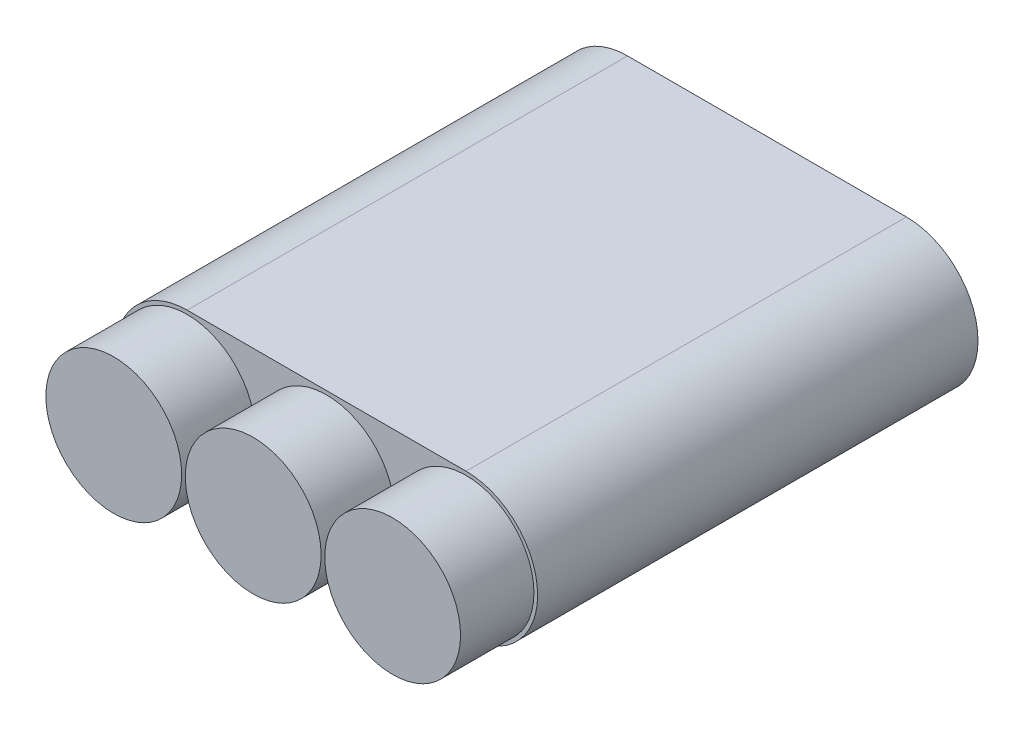
ISO-10303-21;
HEADER;
FILE_DESCRIPTION(('STEP AP214'),'2;1');
FILE_NAME('part.step','',(''),(''),'','','');
FILE_SCHEMA(('AUTOMOTIVE_DESIGN { 1 0 10303 214 1 1 1 1 }'));
ENDSEC;
DATA;
#1=APPLICATION_CONTEXT('core data for automotive mechanical design processes');
#2=APPLICATION_PROTOCOL_DEFINITION('international standard','automotive_design',2000,#1);
#3=PRODUCT_CONTEXT('',#1,'mechanical');
#4=PRODUCT('Part','Part','',(#3));
#5=PRODUCT_RELATED_PRODUCT_CATEGORY('part','',(#4));
#6=PRODUCT_DEFINITION_FORMATION('','',#4);
#7=PRODUCT_DEFINITION_CONTEXT('part definition',#1,'design');
#8=PRODUCT_DEFINITION('design','',#6,#7);
#9=PRODUCT_DEFINITION_SHAPE('','',#8);
#10=(LENGTH_UNIT() NAMED_UNIT(*) SI_UNIT(.MILLI.,.METRE.));
#11=(NAMED_UNIT(*) PLANE_ANGLE_UNIT() SI_UNIT($,.RADIAN.));
#12=(NAMED_UNIT(*) SI_UNIT($,.STERADIAN.) SOLID_ANGLE_UNIT());
#13=UNCERTAINTY_MEASURE_WITH_UNIT(LENGTH_MEASURE(1.E-05),#10,'distance_accuracy_value','');
#14=(GEOMETRIC_REPRESENTATION_CONTEXT(3) GLOBAL_UNCERTAINTY_ASSIGNED_CONTEXT((#13)) GLOBAL_UNIT_ASSIGNED_CONTEXT((#10,
#11,#12)) REPRESENTATION_CONTEXT('',''));
#15=CARTESIAN_POINT('',(0.,0.,0.));
#16=DIRECTION('',(0.,0.,1.));
#17=DIRECTION('',(1.,0.,0.));
#18=AXIS2_PLACEMENT_3D('',#15,#16,#17);
#19=CARTESIAN_POINT('',(-19.,0.,10.));
#20=DIRECTION('',(0.,0.,-1.));
#21=DIRECTION('',(-1.,0.,0.));
#22=AXIS2_PLACEMENT_3D('',#19,#20,#21);
#23=CYLINDRICAL_SURFACE('',#22,9.25);
#24=CARTESIAN_POINT('',(-19.,0.,10.));
#25=DIRECTION('',(0.,0.,1.));
#26=DIRECTION('',(1.,0.,0.));
#27=AXIS2_PLACEMENT_3D('',#24,#25,#26);
#28=CIRCLE('',#27,9.25);
#29=CARTESIAN_POINT('',(-9.75,0.,10.));
#30=VERTEX_POINT('',#29);
#31=EDGE_CURVE('E11',#30,#30,#28,.T.);
#32=ORIENTED_EDGE('',*,*,#31,.F.);
#33=EDGE_LOOP('',(#32));
#34=FACE_BOUND('',#33,.T.);
#35=CARTESIAN_POINT('',(-19.,0.,0.));
#36=DIRECTION('',(0.,0.,1.));
#37=DIRECTION('',(1.,0.,0.));
#38=AXIS2_PLACEMENT_3D('',#35,#36,#37);
#39=CIRCLE('',#38,9.25);
#40=CARTESIAN_POINT('',(-9.75,0.,0.));
#41=VERTEX_POINT('',#40);
#42=EDGE_CURVE('E39',#41,#41,#39,.T.);
#43=ORIENTED_EDGE('',*,*,#42,.T.);
#44=EDGE_LOOP('',(#43));
#45=FACE_BOUND('',#44,.T.);
#46=ADVANCED_FACE('F36',(#34,#45),#23,.T.);
#47=CARTESIAN_POINT('',(0.,0.,10.));
#48=DIRECTION('',(0.,0.,1.));
#49=DIRECTION('',(1.,0.,0.));
#50=AXIS2_PLACEMENT_3D('',#47,#48,#49);
#51=PLANE('',#50);
#52=ORIENTED_EDGE('',*,*,#31,.T.);
#53=EDGE_LOOP('',(#52));
#54=FACE_BOUND('',#53,.T.);
#55=ADVANCED_FACE('F126',(#54),#51,.T.);
#56=CARTESIAN_POINT('',(0.,-9.75000000000001,-60.));
#57=DIRECTION('',(0.,-1.,0.));
#58=DIRECTION('',(1.,0.,0.));
#59=AXIS2_PLACEMENT_3D('',#56,#57,#58);
#60=PLANE('',#59);
#61=DIRECTION('',(1.,0.,0.));
#62=VECTOR('',#61,1.);
#63=CARTESIAN_POINT('',(0.,-9.75000000000001,0.));
#64=LINE('',#63,#62);
#65=CARTESIAN_POINT('',(-19.,-9.75000000000001,0.));
#66=VERTEX_POINT('',#65);
#67=CARTESIAN_POINT('',(19.,-9.75,0.));
#68=VERTEX_POINT('',#67);
#69=EDGE_CURVE('E104',#66,#68,#64,.T.);
#70=ORIENTED_EDGE('',*,*,#69,.F.);
#71=DIRECTION('',(0.,0.,1.));
#72=VECTOR('',#71,1.);
#73=CARTESIAN_POINT('',(-19.,-9.75000000000001,-60.));
#74=LINE('',#73,#72);
#75=CARTESIAN_POINT('',(-19.,-9.75000000000001,-60.));
#76=VERTEX_POINT('',#75);
#77=EDGE_CURVE('E52',#76,#66,#74,.T.);
#78=ORIENTED_EDGE('',*,*,#77,.F.);
#79=DIRECTION('',(1.,0.,0.));
#80=VECTOR('',#79,1.);
#81=CARTESIAN_POINT('',(0.,-9.75000000000001,-60.));
#82=LINE('',#81,#80);
#83=CARTESIAN_POINT('',(19.,-9.75,-60.));
#84=VERTEX_POINT('',#83);
#85=EDGE_CURVE('E97',#76,#84,#82,.T.);
#86=ORIENTED_EDGE('',*,*,#85,.T.);
#87=DIRECTION('',(0.,0.,1.));
#88=VECTOR('',#87,1.);
#89=CARTESIAN_POINT('',(19.,-9.75,-60.));
#90=LINE('',#89,#88);
#91=EDGE_CURVE('E80',#84,#68,#90,.T.);
#92=ORIENTED_EDGE('',*,*,#91,.T.);
#93=EDGE_LOOP('',(#70,#78,#86,#92));
#94=FACE_BOUND('',#93,.T.);
#95=ADVANCED_FACE('F115',(#94),#60,.T.);
#96=CARTESIAN_POINT('',(-19.,0.,-60.));
#97=DIRECTION('',(0.,0.,1.));
#98=DIRECTION('',(1.,0.,0.));
#99=AXIS2_PLACEMENT_3D('',#96,#97,#98);
#100=CYLINDRICAL_SURFACE('',#99,9.75000000000001);
#101=CARTESIAN_POINT('',(-19.,0.,0.));
#102=DIRECTION('',(0.,0.,1.));
#103=DIRECTION('',(1.,0.,0.));
#104=AXIS2_PLACEMENT_3D('',#101,#102,#103);
#105=CIRCLE('',#104,9.75000000000001);
#106=CARTESIAN_POINT('',(-19.,9.75000000000001,0.));
#107=VERTEX_POINT('',#106);
#108=EDGE_CURVE('E99',#107,#66,#105,.T.);
#109=ORIENTED_EDGE('',*,*,#108,.F.);
#110=DIRECTION('',(0.,0.,1.));
#111=VECTOR('',#110,1.);
#112=CARTESIAN_POINT('',(-19.,9.75000000000001,-60.));
#113=LINE('',#112,#111);
#114=CARTESIAN_POINT('',(-19.,9.75000000000001,-60.));
#115=VERTEX_POINT('',#114);
#116=EDGE_CURVE('E69',#115,#107,#113,.T.);
#117=ORIENTED_EDGE('',*,*,#116,.F.);
#118=CARTESIAN_POINT('',(-19.,0.,-60.));
#119=DIRECTION('',(0.,0.,1.));
#120=DIRECTION('',(1.,0.,0.));
#121=AXIS2_PLACEMENT_3D('',#118,#119,#120);
#122=CIRCLE('',#121,9.75000000000001);
#123=EDGE_CURVE('E89',#115,#76,#122,.T.);
#124=ORIENTED_EDGE('',*,*,#123,.T.);
#125=ORIENTED_EDGE('',*,*,#77,.T.);
#126=EDGE_LOOP('',(#109,#117,#124,#125));
#127=FACE_BOUND('',#126,.T.);
#128=ADVANCED_FACE('F118',(#127),#100,.T.);
#129=CARTESIAN_POINT('',(0.,9.75000000000001,-60.));
#130=DIRECTION('',(0.,-1.,0.));
#131=DIRECTION('',(1.,0.,0.));
#132=AXIS2_PLACEMENT_3D('',#129,#130,#131);
#133=PLANE('',#132);
#134=DIRECTION('',(1.,0.,0.));
#135=VECTOR('',#134,1.);
#136=CARTESIAN_POINT('',(0.,9.75000000000001,0.));
#137=LINE('',#136,#135);
#138=CARTESIAN_POINT('',(19.,9.75000000000002,0.));
#139=VERTEX_POINT('',#138);
#140=EDGE_CURVE('E93',#107,#139,#137,.T.);
#141=ORIENTED_EDGE('',*,*,#140,.T.);
#142=DIRECTION('',(0.,0.,1.));
#143=VECTOR('',#142,1.);
#144=CARTESIAN_POINT('',(19.,9.75000000000002,-60.));
#145=LINE('',#144,#143);
#146=CARTESIAN_POINT('',(19.,9.75000000000002,-60.));
#147=VERTEX_POINT('',#146);
#148=EDGE_CURVE('E91',#147,#139,#145,.T.);
#149=ORIENTED_EDGE('',*,*,#148,.F.);
#150=DIRECTION('',(1.,0.,0.));
#151=VECTOR('',#150,1.);
#152=CARTESIAN_POINT('',(0.,9.75000000000001,-60.));
#153=LINE('',#152,#151);
#154=EDGE_CURVE('E85',#115,#147,#153,.T.);
#155=ORIENTED_EDGE('',*,*,#154,.F.);
#156=ORIENTED_EDGE('',*,*,#116,.T.);
#157=EDGE_LOOP('',(#141,#149,#155,#156));
#158=FACE_BOUND('',#157,.T.);
#159=ADVANCED_FACE('F92',(#158),#133,.F.);
#160=CARTESIAN_POINT('',(19.,0.,-60.));
#161=DIRECTION('',(0.,0.,1.));
#162=DIRECTION('',(1.,0.,0.));
#163=AXIS2_PLACEMENT_3D('',#160,#161,#162);
#164=CYLINDRICAL_SURFACE('',#163,9.75000000000001);
#165=CARTESIAN_POINT('',(19.,0.,0.));
#166=DIRECTION('',(0.,0.,1.));
#167=DIRECTION('',(1.,0.,0.));
#168=AXIS2_PLACEMENT_3D('',#165,#166,#167);
#169=CIRCLE('',#168,9.75000000000001);
#170=EDGE_CURVE('E107',#68,#139,#169,.T.);
#171=ORIENTED_EDGE('',*,*,#170,.F.);
#172=ORIENTED_EDGE('',*,*,#91,.F.);
#173=CARTESIAN_POINT('',(19.,0.,-60.));
#174=DIRECTION('',(0.,0.,1.));
#175=DIRECTION('',(1.,0.,0.));
#176=AXIS2_PLACEMENT_3D('',#173,#174,#175);
#177=CIRCLE('',#176,9.75000000000001);
#178=EDGE_CURVE('E88',#84,#147,#177,.T.);
#179=ORIENTED_EDGE('',*,*,#178,.T.);
#180=ORIENTED_EDGE('',*,*,#148,.T.);
#181=EDGE_LOOP('',(#171,#172,#179,#180));
#182=FACE_BOUND('',#181,.T.);
#183=ADVANCED_FACE('F96',(#182),#164,.T.);
#184=CARTESIAN_POINT('',(0.,0.,-60.));
#185=DIRECTION('',(0.,0.,1.));
#186=DIRECTION('',(1.,0.,0.));
#187=AXIS2_PLACEMENT_3D('',#184,#185,#186);
#188=PLANE('',#187);
#189=ORIENTED_EDGE('',*,*,#85,.F.);
#190=ORIENTED_EDGE('',*,*,#123,.F.);
#191=ORIENTED_EDGE('',*,*,#154,.T.);
#192=ORIENTED_EDGE('',*,*,#178,.F.);
#193=EDGE_LOOP('',(#189,#190,#191,#192));
#194=FACE_BOUND('',#193,.T.);
#195=ADVANCED_FACE('F87',(#194),#188,.F.);
#196=CARTESIAN_POINT('',(0.,0.,0.));
#197=DIRECTION('',(0.,0.,1.));
#198=DIRECTION('',(1.,0.,0.));
#199=AXIS2_PLACEMENT_3D('',#196,#197,#198);
#200=PLANE('',#199);
#201=CARTESIAN_POINT('',(19.,0.,0.));
#202=DIRECTION('',(0.,0.,1.));
#203=DIRECTION('',(1.,0.,0.));
#204=AXIS2_PLACEMENT_3D('',#201,#202,#203);
#205=CIRCLE('',#204,9.25000000000001);
#206=CARTESIAN_POINT('',(28.25,0.,0.));
#207=VERTEX_POINT('',#206);
#208=EDGE_CURVE('E170',#207,#207,#205,.T.);
#209=ORIENTED_EDGE('',*,*,#208,.F.);
#210=EDGE_LOOP('',(#209));
#211=FACE_BOUND('',#210,.T.);
#212=CARTESIAN_POINT('',(0.,0.,0.));
#213=DIRECTION('',(0.,0.,1.));
#214=DIRECTION('',(1.,0.,0.));
#215=AXIS2_PLACEMENT_3D('',#212,#213,#214);
#216=CIRCLE('',#215,9.25);
#217=CARTESIAN_POINT('',(9.25,0.,0.));
#218=VERTEX_POINT('',#217);
#219=EDGE_CURVE('E169',#218,#218,#216,.T.);
#220=ORIENTED_EDGE('',*,*,#219,.F.);
#221=EDGE_LOOP('',(#220));
#222=FACE_BOUND('',#221,.T.);
#223=ORIENTED_EDGE('',*,*,#42,.F.);
#224=EDGE_LOOP('',(#223));
#225=FACE_BOUND('',#224,.T.);
#226=ORIENTED_EDGE('',*,*,#69,.T.);
#227=ORIENTED_EDGE('',*,*,#170,.T.);
#228=ORIENTED_EDGE('',*,*,#140,.F.);
#229=ORIENTED_EDGE('',*,*,#108,.T.);
#230=EDGE_LOOP('',(#226,#227,#228,#229));
#231=FACE_BOUND('',#230,.T.);
#232=ADVANCED_FACE('F117',(#211,#222,#225,#231),#200,.T.);
#233=CARTESIAN_POINT('',(0.,0.,10.));
#234=DIRECTION('',(0.,0.,-1.));
#235=DIRECTION('',(-1.,0.,0.));
#236=AXIS2_PLACEMENT_3D('',#233,#234,#235);
#237=CYLINDRICAL_SURFACE('',#236,9.25);
#238=CARTESIAN_POINT('',(0.,0.,10.));
#239=DIRECTION('',(0.,0.,1.));
#240=DIRECTION('',(1.,0.,0.));
#241=AXIS2_PLACEMENT_3D('',#238,#239,#240);
#242=CIRCLE('',#241,9.25);
#243=CARTESIAN_POINT('',(9.25,0.,10.));
#244=VERTEX_POINT('',#243);
#245=EDGE_CURVE('E108',#244,#244,#242,.T.);
#246=ORIENTED_EDGE('',*,*,#245,.F.);
#247=EDGE_LOOP('',(#246));
#248=FACE_BOUND('',#247,.T.);
#249=ORIENTED_EDGE('',*,*,#219,.T.);
#250=EDGE_LOOP('',(#249));
#251=FACE_BOUND('',#250,.T.);
#252=ADVANCED_FACE('F141',(#248,#251),#237,.T.);
#253=CARTESIAN_POINT('',(0.,0.,10.));
#254=DIRECTION('',(0.,0.,1.));
#255=DIRECTION('',(1.,0.,0.));
#256=AXIS2_PLACEMENT_3D('',#253,#254,#255);
#257=PLANE('',#256);
#258=ORIENTED_EDGE('',*,*,#245,.T.);
#259=EDGE_LOOP('',(#258));
#260=FACE_BOUND('',#259,.T.);
#261=ADVANCED_FACE('F147',(#260),#257,.T.);
#262=CARTESIAN_POINT('',(19.,0.,10.));
#263=DIRECTION('',(0.,0.,-1.));
#264=DIRECTION('',(-1.,0.,0.));
#265=AXIS2_PLACEMENT_3D('',#262,#263,#264);
#266=CYLINDRICAL_SURFACE('',#265,9.25000000000001);
#267=CARTESIAN_POINT('',(19.,0.,10.));
#268=DIRECTION('',(0.,0.,1.));
#269=DIRECTION('',(1.,0.,0.));
#270=AXIS2_PLACEMENT_3D('',#267,#268,#269);
#271=CIRCLE('',#270,9.25000000000001);
#272=CARTESIAN_POINT('',(28.25,0.,10.));
#273=VERTEX_POINT('',#272);
#274=EDGE_CURVE('E168',#273,#273,#271,.T.);
#275=ORIENTED_EDGE('',*,*,#274,.F.);
#276=EDGE_LOOP('',(#275));
#277=FACE_BOUND('',#276,.T.);
#278=ORIENTED_EDGE('',*,*,#208,.T.);
#279=EDGE_LOOP('',(#278));
#280=FACE_BOUND('',#279,.T.);
#281=ADVANCED_FACE('F156',(#277,#280),#266,.T.);
#282=CARTESIAN_POINT('',(0.,0.,10.));
#283=DIRECTION('',(0.,0.,1.));
#284=DIRECTION('',(1.,0.,0.));
#285=AXIS2_PLACEMENT_3D('',#282,#283,#284);
#286=PLANE('',#285);
#287=ORIENTED_EDGE('',*,*,#274,.T.);
#288=EDGE_LOOP('',(#287));
#289=FACE_BOUND('',#288,.T.);
#290=ADVANCED_FACE('F160',(#289),#286,.T.);
#291=CLOSED_SHELL('',(#46,#55,#95,#128,#159,#183,#195,#232,#252,#261,#281,#290));
#292=MANIFOLD_SOLID_BREP('B2',#291);
#293=ADVANCED_BREP_SHAPE_REPRESENTATION('',(#18,#292),#14);
#294=SHAPE_DEFINITION_REPRESENTATION(#9,#293);
ENDSEC;
END-ISO-10303-21;
